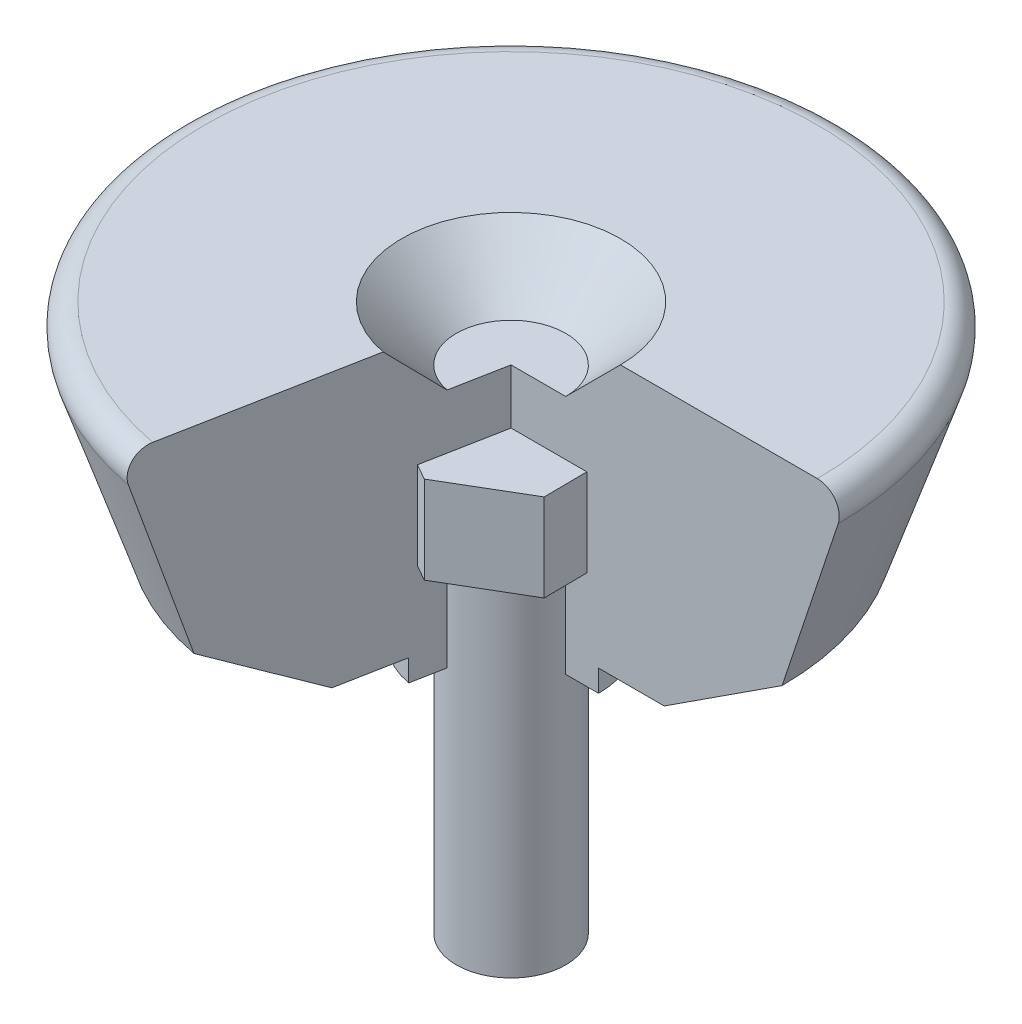
ISO-10303-21;
HEADER;
FILE_DESCRIPTION(('STEP AP214'),'2;1');
FILE_NAME('part.step','',(''),(''),'','','');
FILE_SCHEMA(('AUTOMOTIVE_DESIGN { 1 0 10303 214 1 1 1 1 }'));
ENDSEC;
DATA;
#1=APPLICATION_CONTEXT('core data for automotive mechanical design processes');
#2=APPLICATION_PROTOCOL_DEFINITION('international standard','automotive_design',2000,#1);
#3=PRODUCT_CONTEXT('',#1,'mechanical');
#4=PRODUCT('Part','Part','',(#3));
#5=PRODUCT_RELATED_PRODUCT_CATEGORY('part','',(#4));
#6=PRODUCT_DEFINITION_FORMATION('','',#4);
#7=PRODUCT_DEFINITION_CONTEXT('part definition',#1,'design');
#8=PRODUCT_DEFINITION('design','',#6,#7);
#9=PRODUCT_DEFINITION_SHAPE('','',#8);
#10=(LENGTH_UNIT() NAMED_UNIT(*) SI_UNIT(.MILLI.,.METRE.));
#11=(NAMED_UNIT(*) PLANE_ANGLE_UNIT() SI_UNIT($,.RADIAN.));
#12=(NAMED_UNIT(*) SI_UNIT($,.STERADIAN.) SOLID_ANGLE_UNIT());
#13=UNCERTAINTY_MEASURE_WITH_UNIT(LENGTH_MEASURE(1.E-05),#10,'distance_accuracy_value','');
#14=(GEOMETRIC_REPRESENTATION_CONTEXT(3) GLOBAL_UNCERTAINTY_ASSIGNED_CONTEXT((#13)) GLOBAL_UNIT_ASSIGNED_CONTEXT((#10,
#11,#12)) REPRESENTATION_CONTEXT('',''));
#15=CARTESIAN_POINT('',(0.,0.,0.));
#16=DIRECTION('',(0.,0.,1.));
#17=DIRECTION('',(1.,0.,0.));
#18=AXIS2_PLACEMENT_3D('',#15,#16,#17);
#19=CARTESIAN_POINT('',(0.,0.,0.));
#20=DIRECTION('',(0.,1.,0.));
#21=DIRECTION('',(0.,0.,1.));
#22=AXIS2_PLACEMENT_3D('',#19,#20,#21);
#23=CYLINDRICAL_SURFACE('',#22,5.);
#24=CARTESIAN_POINT('',(0.,0.,0.));
#25=DIRECTION('',(0.,1.,0.));
#26=DIRECTION('',(0.,0.,1.));
#27=AXIS2_PLACEMENT_3D('',#24,#25,#26);
#28=CIRCLE('',#27,5.);
#29=CARTESIAN_POINT('',(0.,0.,5.));
#30=VERTEX_POINT('',#29);
#31=EDGE_CURVE('E12',#30,#30,#28,.T.);
#32=ORIENTED_EDGE('',*,*,#31,.T.);
#33=EDGE_LOOP('',(#32));
#34=FACE_BOUND('',#33,.T.);
#35=CARTESIAN_POINT('',(0.,32.,0.));
#36=DIRECTION('',(0.,1.,0.));
#37=DIRECTION('',(0.,0.,1.));
#38=AXIS2_PLACEMENT_3D('',#35,#36,#37);
#39=CIRCLE('',#38,5.);
#40=CARTESIAN_POINT('',(0.,32.,5.));
#41=VERTEX_POINT('',#40);
#42=EDGE_CURVE('E47',#41,#41,#39,.T.);
#43=ORIENTED_EDGE('',*,*,#42,.F.);
#44=EDGE_LOOP('',(#43));
#45=FACE_BOUND('',#44,.T.);
#46=ADVANCED_FACE('F44',(#34,#45),#23,.T.);
#47=CARTESIAN_POINT('',(0.,0.,0.));
#48=DIRECTION('',(0.,1.,0.));
#49=DIRECTION('',(0.,0.,1.));
#50=AXIS2_PLACEMENT_3D('',#47,#48,#49);
#51=PLANE('',#50);
#52=ORIENTED_EDGE('',*,*,#31,.F.);
#53=EDGE_LOOP('',(#52));
#54=FACE_BOUND('',#53,.T.);
#55=ADVANCED_FACE('F59',(#54),#51,.F.);
#56=CARTESIAN_POINT('',(0.,32.,0.));
#57=DIRECTION('',(0.,1.,0.));
#58=DIRECTION('',(0.,0.,1.));
#59=AXIS2_PLACEMENT_3D('',#56,#57,#58);
#60=PLANE('',#59);
#61=ORIENTED_EDGE('',*,*,#42,.T.);
#62=EDGE_LOOP('',(#61));
#63=FACE_BOUND('',#62,.T.);
#64=ADVANCED_FACE('F56',(#63),#60,.T.);
#65=CLOSED_SHELL('',(#46,#55,#64));
#66=MANIFOLD_SOLID_BREP('B2',#65);
#67=CARTESIAN_POINT('',(6.89136035458419,32.,-4.06314563648232));
#68=DIRECTION('',(0.492065039432711,0.,-0.870558439720209));
#69=DIRECTION('',(-0.870558439720209,0.,-0.492065039432711));
#70=AXIS2_PLACEMENT_3D('',#67,#68,#69);
#71=PLANE('',#70);
#72=DIRECTION('',(-0.870558439720209,0.,-0.492065039432711));
#73=VECTOR('',#72,1.);
#74=CARTESIAN_POINT('',(6.89136035458419,40.,-4.06314563648232));
#75=LINE('',#74,#73);
#76=CARTESIAN_POINT('',(6.89136035458419,40.,-4.06314563648232));
#77=VERTEX_POINT('',#76);
#78=CARTESIAN_POINT('',(-0.0731071631774839,40.,-7.999665951944));
#79=VERTEX_POINT('',#78);
#80=EDGE_CURVE('E179',#77,#79,#75,.T.);
#81=ORIENTED_EDGE('',*,*,#80,.F.);
#82=DIRECTION('',(0.,1.,0.));
#83=VECTOR('',#82,1.);
#84=CARTESIAN_POINT('',(6.89136035458419,32.,-4.06314563648232));
#85=LINE('',#84,#83);
#86=CARTESIAN_POINT('',(6.89136035458419,32.,-4.06314563648232));
#87=VERTEX_POINT('',#86);
#88=EDGE_CURVE('E42',#87,#77,#85,.T.);
#89=ORIENTED_EDGE('',*,*,#88,.F.);
#90=DIRECTION('',(-0.870558439720209,0.,-0.492065039432711));
#91=VECTOR('',#90,1.);
#92=CARTESIAN_POINT('',(6.89136035458419,32.,-4.06314563648232));
#93=LINE('',#92,#91);
#94=CARTESIAN_POINT('',(-0.0731071631774839,32.,-7.999665951944));
#95=VERTEX_POINT('',#94);
#96=EDGE_CURVE('E193',#87,#95,#93,.T.);
#97=ORIENTED_EDGE('',*,*,#96,.T.);
#98=DIRECTION('',(0.,1.,0.));
#99=VECTOR('',#98,1.);
#100=CARTESIAN_POINT('',(-0.0731071631774839,32.,-7.999665951944));
#101=LINE('',#100,#99);
#102=EDGE_CURVE('E97',#95,#79,#101,.T.);
#103=ORIENTED_EDGE('',*,*,#102,.T.);
#104=EDGE_LOOP('',(#81,#89,#97,#103));
#105=FACE_BOUND('',#104,.T.);
#106=ADVANCED_FACE('F94',(#105),#71,.T.);
#107=CARTESIAN_POINT('',(6.96446751776167,32.,3.93652031546169));
#108=DIRECTION('',(0.999958243993,0.,-0.00913839539718527));
#109=DIRECTION('',(-0.00913839539718527,0.,-0.999958243993));
#110=AXIS2_PLACEMENT_3D('',#107,#108,#109);
#111=PLANE('',#110);
#112=DIRECTION('',(-0.00913839539718527,0.,-0.999958243993));
#113=VECTOR('',#112,1.);
#114=CARTESIAN_POINT('',(6.96446751776167,40.,3.93652031546169));
#115=LINE('',#114,#113);
#116=CARTESIAN_POINT('',(6.96446751776167,40.,3.93652031546169));
#117=VERTEX_POINT('',#116);
#118=EDGE_CURVE('E191',#117,#77,#115,.T.);
#119=ORIENTED_EDGE('',*,*,#118,.F.);
#120=DIRECTION('',(0.,1.,0.));
#121=VECTOR('',#120,1.);
#122=CARTESIAN_POINT('',(6.96446751776167,32.,3.93652031546169));
#123=LINE('',#122,#121);
#124=CARTESIAN_POINT('',(6.96446751776167,32.,3.93652031546169));
#125=VERTEX_POINT('',#124);
#126=EDGE_CURVE('E103',#125,#117,#123,.T.);
#127=ORIENTED_EDGE('',*,*,#126,.F.);
#128=DIRECTION('',(-0.00913839539718527,0.,-0.999958243993));
#129=VECTOR('',#128,1.);
#130=CARTESIAN_POINT('',(6.96446751776167,32.,3.93652031546169));
#131=LINE('',#130,#129);
#132=EDGE_CURVE('E169',#125,#87,#131,.T.);
#133=ORIENTED_EDGE('',*,*,#132,.T.);
#134=ORIENTED_EDGE('',*,*,#88,.T.);
#135=EDGE_LOOP('',(#119,#127,#133,#134));
#136=FACE_BOUND('',#135,.T.);
#137=ADVANCED_FACE('F201',(#136),#111,.T.);
#138=CARTESIAN_POINT('',(0.0731071631774813,32.,7.999665951944));
#139=DIRECTION('',(0.507893204560289,0.,0.861420044323024));
#140=DIRECTION('',(0.861420044323024,0.,-0.507893204560289));
#141=AXIS2_PLACEMENT_3D('',#138,#139,#140);
#142=PLANE('',#141);
#143=DIRECTION('',(0.861420044323024,0.,-0.507893204560289));
#144=VECTOR('',#143,1.);
#145=CARTESIAN_POINT('',(0.0731071631774813,40.,7.999665951944));
#146=LINE('',#145,#144);
#147=CARTESIAN_POINT('',(0.0731071631774813,40.,7.999665951944));
#148=VERTEX_POINT('',#147);
#149=EDGE_CURVE('E156',#148,#117,#146,.T.);
#150=ORIENTED_EDGE('',*,*,#149,.F.);
#151=DIRECTION('',(0.,1.,0.));
#152=VECTOR('',#151,1.);
#153=CARTESIAN_POINT('',(0.0731071631774813,32.,7.999665951944));
#154=LINE('',#153,#152);
#155=CARTESIAN_POINT('',(0.0731071631774813,32.,7.999665951944));
#156=VERTEX_POINT('',#155);
#157=EDGE_CURVE('E151',#156,#148,#154,.T.);
#158=ORIENTED_EDGE('',*,*,#157,.F.);
#159=DIRECTION('',(0.861420044323024,0.,-0.507893204560289));
#160=VECTOR('',#159,1.);
#161=CARTESIAN_POINT('',(0.0731071631774813,32.,7.999665951944));
#162=LINE('',#161,#160);
#163=EDGE_CURVE('E154',#156,#125,#162,.T.);
#164=ORIENTED_EDGE('',*,*,#163,.T.);
#165=ORIENTED_EDGE('',*,*,#126,.T.);
#166=EDGE_LOOP('',(#150,#158,#164,#165));
#167=FACE_BOUND('',#166,.T.);
#168=ADVANCED_FACE('F153',(#167),#142,.T.);
#169=CARTESIAN_POINT('',(-6.89136035458419,32.,4.06314563648231));
#170=DIRECTION('',(-0.492065039432711,0.,0.870558439720209));
#171=DIRECTION('',(0.870558439720209,0.,0.492065039432711));
#172=AXIS2_PLACEMENT_3D('',#169,#170,#171);
#173=PLANE('',#172);
#174=DIRECTION('',(0.870558439720209,0.,0.492065039432711));
#175=VECTOR('',#174,1.);
#176=CARTESIAN_POINT('',(-6.89136035458419,40.,4.06314563648231));
#177=LINE('',#176,#175);
#178=CARTESIAN_POINT('',(-6.89136035458419,40.,4.06314563648231));
#179=VERTEX_POINT('',#178);
#180=EDGE_CURVE('E188',#179,#148,#177,.T.);
#181=ORIENTED_EDGE('',*,*,#180,.F.);
#182=DIRECTION('',(0.,1.,0.));
#183=VECTOR('',#182,1.);
#184=CARTESIAN_POINT('',(-6.89136035458419,32.,4.06314563648231));
#185=LINE('',#184,#183);
#186=CARTESIAN_POINT('',(-6.89136035458419,32.,4.06314563648231));
#187=VERTEX_POINT('',#186);
#188=EDGE_CURVE('E161',#187,#179,#185,.T.);
#189=ORIENTED_EDGE('',*,*,#188,.F.);
#190=DIRECTION('',(0.870558439720209,0.,0.492065039432711));
#191=VECTOR('',#190,1.);
#192=CARTESIAN_POINT('',(-6.89136035458419,32.,4.06314563648231));
#193=LINE('',#192,#191);
#194=EDGE_CURVE('E167',#187,#156,#193,.T.);
#195=ORIENTED_EDGE('',*,*,#194,.T.);
#196=ORIENTED_EDGE('',*,*,#157,.T.);
#197=EDGE_LOOP('',(#181,#189,#195,#196));
#198=FACE_BOUND('',#197,.T.);
#199=ADVANCED_FACE('F171',(#198),#173,.T.);
#200=CARTESIAN_POINT('',(-6.96446751776167,32.,-3.93652031546169));
#201=DIRECTION('',(-0.999958243993,0.,0.00913839539718538));
#202=DIRECTION('',(0.00913839539718538,0.,0.999958243993));
#203=AXIS2_PLACEMENT_3D('',#200,#201,#202);
#204=PLANE('',#203);
#205=DIRECTION('',(0.00913839539718538,0.,0.999958243993));
#206=VECTOR('',#205,1.);
#207=CARTESIAN_POINT('',(-6.96446751776167,40.,-3.93652031546169));
#208=LINE('',#207,#206);
#209=CARTESIAN_POINT('',(-6.96446751776167,40.,-3.93652031546169));
#210=VERTEX_POINT('',#209);
#211=EDGE_CURVE('E185',#210,#179,#208,.T.);
#212=ORIENTED_EDGE('',*,*,#211,.F.);
#213=DIRECTION('',(0.,1.,0.));
#214=VECTOR('',#213,1.);
#215=CARTESIAN_POINT('',(-6.96446751776167,32.,-3.93652031546169));
#216=LINE('',#215,#214);
#217=CARTESIAN_POINT('',(-6.96446751776167,32.,-3.93652031546169));
#218=VERTEX_POINT('',#217);
#219=EDGE_CURVE('E196',#218,#210,#216,.T.);
#220=ORIENTED_EDGE('',*,*,#219,.F.);
#221=DIRECTION('',(0.00913839539718538,0.,0.999958243993));
#222=VECTOR('',#221,1.);
#223=CARTESIAN_POINT('',(-6.96446751776167,32.,-3.93652031546169));
#224=LINE('',#223,#222);
#225=EDGE_CURVE('E172',#218,#187,#224,.T.);
#226=ORIENTED_EDGE('',*,*,#225,.T.);
#227=ORIENTED_EDGE('',*,*,#188,.T.);
#228=EDGE_LOOP('',(#212,#220,#226,#227));
#229=FACE_BOUND('',#228,.T.);
#230=ADVANCED_FACE('F214',(#229),#204,.T.);
#231=CARTESIAN_POINT('',(-0.0731071631774839,32.,-7.999665951944));
#232=DIRECTION('',(-0.50789320456029,0.,-0.861420044323024));
#233=DIRECTION('',(-0.861420044323024,0.,0.50789320456029));
#234=AXIS2_PLACEMENT_3D('',#231,#232,#233);
#235=PLANE('',#234);
#236=DIRECTION('',(-0.861420044323024,0.,0.50789320456029));
#237=VECTOR('',#236,1.);
#238=CARTESIAN_POINT('',(-0.0731071631774839,40.,-7.999665951944));
#239=LINE('',#238,#237);
#240=EDGE_CURVE('E182',#79,#210,#239,.T.);
#241=ORIENTED_EDGE('',*,*,#240,.F.);
#242=ORIENTED_EDGE('',*,*,#102,.F.);
#243=DIRECTION('',(-0.861420044323024,0.,0.50789320456029));
#244=VECTOR('',#243,1.);
#245=CARTESIAN_POINT('',(-0.0731071631774839,32.,-7.999665951944));
#246=LINE('',#245,#244);
#247=EDGE_CURVE('E174',#95,#218,#246,.T.);
#248=ORIENTED_EDGE('',*,*,#247,.T.);
#249=ORIENTED_EDGE('',*,*,#219,.T.);
#250=EDGE_LOOP('',(#241,#242,#248,#249));
#251=FACE_BOUND('',#250,.T.);
#252=ADVANCED_FACE('F198',(#251),#235,.T.);
#253=CARTESIAN_POINT('',(0.,32.,0.));
#254=DIRECTION('',(0.,1.,0.));
#255=DIRECTION('',(0.,0.,1.));
#256=AXIS2_PLACEMENT_3D('',#253,#254,#255);
#257=PLANE('',#256);
#258=ORIENTED_EDGE('',*,*,#96,.F.);
#259=ORIENTED_EDGE('',*,*,#132,.F.);
#260=ORIENTED_EDGE('',*,*,#163,.F.);
#261=ORIENTED_EDGE('',*,*,#194,.F.);
#262=ORIENTED_EDGE('',*,*,#225,.F.);
#263=ORIENTED_EDGE('',*,*,#247,.F.);
#264=EDGE_LOOP('',(#258,#259,#260,#261,#262,#263));
#265=FACE_BOUND('',#264,.T.);
#266=ADVANCED_FACE('F165',(#265),#257,.F.);
#267=CARTESIAN_POINT('',(0.,40.,0.));
#268=DIRECTION('',(0.,1.,0.));
#269=DIRECTION('',(0.,0.,1.));
#270=AXIS2_PLACEMENT_3D('',#267,#268,#269);
#271=PLANE('',#270);
#272=ORIENTED_EDGE('',*,*,#80,.T.);
#273=ORIENTED_EDGE('',*,*,#240,.T.);
#274=ORIENTED_EDGE('',*,*,#211,.T.);
#275=ORIENTED_EDGE('',*,*,#180,.T.);
#276=ORIENTED_EDGE('',*,*,#149,.T.);
#277=ORIENTED_EDGE('',*,*,#118,.T.);
#278=EDGE_LOOP('',(#272,#273,#274,#275,#276,#277));
#279=FACE_BOUND('',#278,.T.);
#280=ADVANCED_FACE('F200',(#279),#271,.T.);
#281=CLOSED_SHELL('',(#106,#137,#168,#199,#230,#252,#266,#280));
#282=MANIFOLD_SOLID_BREP('B7',#281);
#283=CARTESIAN_POINT('',(-5.24667680839211,48.,27.5040430204048));
#284=DIRECTION('',(0.982287250728744,0.,0.187381314585432));
#285=DIRECTION('',(0.187381314585432,0.,-0.982287250728744));
#286=AXIS2_PLACEMENT_3D('',#283,#284,#285);
#287=PLANE('',#286);
#288=DIRECTION('',(0.,-1.,0.));
#289=VECTOR('',#288,1.);
#290=CARTESIAN_POINT('',(0.,50.,0.));
#291=LINE('',#290,#289);
#292=CARTESIAN_POINT('',(0.,45.,0.));
#293=VERTEX_POINT('',#292);
#294=CARTESIAN_POINT('',(0.,23.,0.));
#295=VERTEX_POINT('',#294);
#296=EDGE_CURVE('E363',#293,#295,#291,.T.);
#297=ORIENTED_EDGE('',*,*,#296,.F.);
#298=DIRECTION('',(-0.187381314585432,0.,0.982287250728744));
#299=VECTOR('',#298,1.);
#300=CARTESIAN_POINT('',(-5.24667680839211,45.,27.5040430204048));
#301=LINE('',#300,#299);
#302=CARTESIAN_POINT('',(-0.936906289233362,45.,4.91143476570809));
#303=VERTEX_POINT('',#302);
#304=EDGE_CURVE('E421',#293,#303,#301,.T.);
#305=ORIENTED_EDGE('',*,*,#304,.T.);
#306=DIRECTION('',(0.132498598211009,-0.707106781186548,-0.694581976063385));
#307=VECTOR('',#306,1.);
#308=CARTESIAN_POINT('',(0.,40.,0.));
#309=LINE('',#308,#307);
#310=CARTESIAN_POINT('',(-1.87381341300556,50.,9.82287390745386));
#311=VERTEX_POINT('',#310);
#312=EDGE_CURVE('E420',#311,#303,#309,.T.);
#313=ORIENTED_EDGE('',*,*,#312,.F.);
#314=DIRECTION('',(0.187381314585432,0.,-0.982287250728744));
#315=VECTOR('',#314,1.);
#316=CARTESIAN_POINT('',(-5.24667680839211,50.,27.5040430204048));
#317=LINE('',#316,#315);
#318=CARTESIAN_POINT('',(-5.24667680839211,50.,27.5040430204048));
#319=VERTEX_POINT('',#318);
#320=EDGE_CURVE('E355',#319,#311,#317,.T.);
#321=ORIENTED_EDGE('',*,*,#320,.F.);
#322=CARTESIAN_POINT('',(-5.24667680839211,48.,27.5040430204048));
#323=DIRECTION('',(-0.982287250728744,0.,-0.187381314585432));
#324=DIRECTION('',(0.187381314585432,0.,-0.982287250728744));
#325=AXIS2_PLACEMENT_3D('',#322,#323,#324);
#326=CIRCLE('',#325,2.);
#327=CARTESIAN_POINT('',(-5.60220785542,47.3675444679663,29.3678020377135));
#328=VERTEX_POINT('',#327);
#329=EDGE_CURVE('E390',#328,#319,#326,.T.);
#330=ORIENTED_EDGE('',*,*,#329,.F.);
#331=DIRECTION('',(-0.0592551745046496,0.948683298050514,0.310626502884773));
#332=VECTOR('',#331,1.);
#333=CARTESIAN_POINT('',(-4.64234429396746,32.,24.33602103575));
#334=LINE('',#333,#332);
#335=CARTESIAN_POINT('',(-4.64234429396746,32.,24.33602103575));
#336=VERTEX_POINT('',#335);
#337=EDGE_CURVE('E387',#336,#328,#334,.T.);
#338=ORIENTED_EDGE('',*,*,#337,.F.);
#339=DIRECTION('',(-0.157133009507986,0.54478843876995,0.823720082494996));
#340=VECTOR('',#339,1.);
#341=CARTESIAN_POINT('',(-2.62333840419605,25.,13.7520215102024));
#342=LINE('',#341,#340);
#343=CARTESIAN_POINT('',(-2.62333840419605,25.,13.7520215102024));
#344=VERTEX_POINT('',#343);
#345=EDGE_CURVE('E384',#344,#336,#342,.T.);
#346=ORIENTED_EDGE('',*,*,#345,.F.);
#347=DIRECTION('',(-0.187381314585432,0.,0.982287250728744));
#348=VECTOR('',#347,1.);
#349=CARTESIAN_POINT('',(-1.49905051668346,25.,7.85829800582996));
#350=LINE('',#349,#348);
#351=CARTESIAN_POINT('',(-1.49905051668346,25.,7.85829800582996));
#352=VERTEX_POINT('',#351);
#353=EDGE_CURVE('E381',#352,#344,#350,.T.);
#354=ORIENTED_EDGE('',*,*,#353,.F.);
#355=DIRECTION('',(0.,1.,0.));
#356=VECTOR('',#355,1.);
#357=CARTESIAN_POINT('',(-1.49905051668346,23.,7.85829800582996));
#358=LINE('',#357,#356);
#359=CARTESIAN_POINT('',(-1.49905051668346,23.,7.85829800582996));
#360=VERTEX_POINT('',#359);
#361=EDGE_CURVE('E378',#360,#352,#358,.T.);
#362=ORIENTED_EDGE('',*,*,#361,.F.);
#363=DIRECTION('',(-0.187381314585432,0.,0.982287250728744));
#364=VECTOR('',#363,1.);
#365=CARTESIAN_POINT('',(0.,23.,0.));
#366=LINE('',#365,#364);
#367=EDGE_CURVE('E365',#295,#360,#366,.T.);
#368=ORIENTED_EDGE('',*,*,#367,.F.);
#369=EDGE_LOOP('',(#297,#305,#313,#321,#330,#338,#346,#354,#362,#368));
#370=FACE_BOUND('',#369,.T.);
#371=ADVANCED_FACE('F270',(#370),#287,.T.);
#372=CARTESIAN_POINT('',(28.,48.,0.));
#373=DIRECTION('',(0.,0.,-1.));
#374=DIRECTION('',(-1.,0.,0.));
#375=AXIS2_PLACEMENT_3D('',#372,#373,#374);
#376=PLANE('',#375);
#377=DIRECTION('',(1.,0.,0.));
#378=VECTOR('',#377,1.);
#379=CARTESIAN_POINT('',(28.,45.,0.));
#380=LINE('',#379,#378);
#381=CARTESIAN_POINT('',(5.,45.,0.));
#382=VERTEX_POINT('',#381);
#383=EDGE_CURVE('E92',#293,#382,#380,.T.);
#384=ORIENTED_EDGE('',*,*,#383,.F.);
#385=ORIENTED_EDGE('',*,*,#296,.T.);
#386=DIRECTION('',(1.,0.,0.));
#387=VECTOR('',#386,1.);
#388=CARTESIAN_POINT('',(0.,23.,0.));
#389=LINE('',#388,#387);
#390=CARTESIAN_POINT('',(8.,23.,0.));
#391=VERTEX_POINT('',#390);
#392=EDGE_CURVE('E423',#295,#391,#389,.T.);
#393=ORIENTED_EDGE('',*,*,#392,.T.);
#394=DIRECTION('',(0.,1.,0.));
#395=VECTOR('',#394,1.);
#396=CARTESIAN_POINT('',(8.,23.,0.));
#397=LINE('',#396,#395);
#398=CARTESIAN_POINT('',(8.,25.,0.));
#399=VERTEX_POINT('',#398);
#400=EDGE_CURVE('E433',#391,#399,#397,.T.);
#401=ORIENTED_EDGE('',*,*,#400,.T.);
#402=DIRECTION('',(1.,0.,0.));
#403=VECTOR('',#402,1.);
#404=CARTESIAN_POINT('',(8.,25.,0.));
#405=LINE('',#404,#403);
#406=CARTESIAN_POINT('',(14.,25.,0.));
#407=VERTEX_POINT('',#406);
#408=EDGE_CURVE('E435',#399,#407,#405,.T.);
#409=ORIENTED_EDGE('',*,*,#408,.T.);
#410=DIRECTION('',(0.838573525090436,0.54478843876995,0.));
#411=VECTOR('',#410,1.);
#412=CARTESIAN_POINT('',(14.,25.,0.));
#413=LINE('',#412,#411);
#414=CARTESIAN_POINT('',(24.7748517734456,32.,0.));
#415=VERTEX_POINT('',#414);
#416=EDGE_CURVE('E438',#407,#415,#413,.T.);
#417=ORIENTED_EDGE('',*,*,#416,.T.);
#418=DIRECTION('',(0.316227766016838,0.948683298050514,0.));
#419=VECTOR('',#418,1.);
#420=CARTESIAN_POINT('',(24.7748517734456,32.,0.));
#421=LINE('',#420,#419);
#422=CARTESIAN_POINT('',(29.897366596101,47.3675444679663,0.));
#423=VERTEX_POINT('',#422);
#424=EDGE_CURVE('E367',#415,#423,#421,.T.);
#425=ORIENTED_EDGE('',*,*,#424,.T.);
#426=CARTESIAN_POINT('',(28.,48.,0.));
#427=DIRECTION('',(0.,0.,1.));
#428=DIRECTION('',(-1.,0.,0.));
#429=AXIS2_PLACEMENT_3D('',#426,#427,#428);
#430=CIRCLE('',#429,2.);
#431=CARTESIAN_POINT('',(28.,50.,0.));
#432=VERTEX_POINT('',#431);
#433=EDGE_CURVE('E362',#423,#432,#430,.T.);
#434=ORIENTED_EDGE('',*,*,#433,.T.);
#435=DIRECTION('',(-1.,0.,0.));
#436=VECTOR('',#435,1.);
#437=CARTESIAN_POINT('',(28.,50.,0.));
#438=LINE('',#437,#436);
#439=CARTESIAN_POINT('',(10.,50.,0.));
#440=VERTEX_POINT('',#439);
#441=EDGE_CURVE('E353',#432,#440,#438,.T.);
#442=ORIENTED_EDGE('',*,*,#441,.T.);
#443=DIRECTION('',(-0.707106781186547,-0.707106781186548,0.));
#444=VECTOR('',#443,1.);
#445=CARTESIAN_POINT('',(0.,40.,0.));
#446=LINE('',#445,#444);
#447=EDGE_CURVE('E281',#440,#382,#446,.T.);
#448=ORIENTED_EDGE('',*,*,#447,.T.);
#449=EDGE_LOOP('',(#384,#385,#393,#401,#409,#417,#425,#434,#442,#448));
#450=FACE_BOUND('',#449,.T.);
#451=ADVANCED_FACE('F359',(#450),#376,.F.);
#452=CARTESIAN_POINT('',(-5.24667680839211,50.,27.5040430204048));
#453=DIRECTION('',(0.,1.,0.));
#454=DIRECTION('',(0.,0.,1.));
#455=AXIS2_PLACEMENT_3D('',#452,#453,#454);
#456=PLANE('',#455);
#457=CARTESIAN_POINT('',(0.,50.,0.));
#458=DIRECTION('',(0.,1.,0.));
#459=DIRECTION('',(0.,0.,1.));
#460=AXIS2_PLACEMENT_3D('',#457,#458,#459);
#461=CIRCLE('',#460,10.);
#462=EDGE_CURVE('E345',#440,#311,#461,.T.);
#463=ORIENTED_EDGE('',*,*,#462,.F.);
#464=ORIENTED_EDGE('',*,*,#441,.F.);
#465=CARTESIAN_POINT('',(0.,50.,0.));
#466=DIRECTION('',(0.,-1.,0.));
#467=DIRECTION('',(0.,0.,-1.));
#468=AXIS2_PLACEMENT_3D('',#465,#466,#467);
#469=CIRCLE('',#468,28.);
#470=EDGE_CURVE('E296',#319,#432,#469,.T.);
#471=ORIENTED_EDGE('',*,*,#470,.F.);
#472=ORIENTED_EDGE('',*,*,#320,.T.);
#473=EDGE_LOOP('',(#463,#464,#471,#472));
#474=FACE_BOUND('',#473,.T.);
#475=ADVANCED_FACE('F272',(#474),#456,.T.);
#476=CARTESIAN_POINT('',(0.,48.,0.));
#477=DIRECTION('',(0.,-1.,0.));
#478=DIRECTION('',(0.,0.,-1.));
#479=AXIS2_PLACEMENT_3D('',#476,#477,#478);
#480=TOROIDAL_SURFACE('',#479,28.,2.);
#481=CARTESIAN_POINT('',(0.,47.3675444679663,0.));
#482=DIRECTION('',(0.,-1.,0.));
#483=DIRECTION('',(0.,0.,-1.));
#484=AXIS2_PLACEMENT_3D('',#481,#482,#483);
#485=CIRCLE('',#484,29.897366596101);
#486=EDGE_CURVE('E410',#328,#423,#485,.T.);
#487=ORIENTED_EDGE('',*,*,#486,.F.);
#488=ORIENTED_EDGE('',*,*,#329,.T.);
#489=ORIENTED_EDGE('',*,*,#470,.T.);
#490=ORIENTED_EDGE('',*,*,#433,.F.);
#491=EDGE_LOOP('',(#487,#488,#489,#490));
#492=FACE_BOUND('',#491,.T.);
#493=ADVANCED_FACE('F414',(#492),#480,.T.);
#494=CARTESIAN_POINT('',(0.,32.,0.));
#495=DIRECTION('',(0.,1.,0.));
#496=DIRECTION('',(0.,0.,1.));
#497=AXIS2_PLACEMENT_3D('',#494,#495,#496);
#498=CONICAL_SURFACE('',#497,24.7748517734456,0.321750554396642);
#499=CARTESIAN_POINT('',(0.,32.,0.));
#500=DIRECTION('',(0.,-1.,0.));
#501=DIRECTION('',(0.,0.,-1.));
#502=AXIS2_PLACEMENT_3D('',#499,#500,#501);
#503=CIRCLE('',#502,24.7748517734456);
#504=EDGE_CURVE('E407',#336,#415,#503,.T.);
#505=ORIENTED_EDGE('',*,*,#504,.F.);
#506=ORIENTED_EDGE('',*,*,#337,.T.);
#507=ORIENTED_EDGE('',*,*,#486,.T.);
#508=ORIENTED_EDGE('',*,*,#424,.F.);
#509=EDGE_LOOP('',(#505,#506,#507,#508));
#510=FACE_BOUND('',#509,.T.);
#511=ADVANCED_FACE('F441',(#510),#498,.T.);
#512=CARTESIAN_POINT('',(0.,25.,0.));
#513=DIRECTION('',(0.,1.,0.));
#514=DIRECTION('',(0.,0.,1.));
#515=AXIS2_PLACEMENT_3D('',#512,#513,#514);
#516=CONICAL_SURFACE('',#515,14.,0.994659519776935);
#517=CARTESIAN_POINT('',(0.,25.,0.));
#518=DIRECTION('',(0.,-1.,0.));
#519=DIRECTION('',(0.,0.,-1.));
#520=AXIS2_PLACEMENT_3D('',#517,#518,#519);
#521=CIRCLE('',#520,14.);
#522=EDGE_CURVE('E403',#344,#407,#521,.T.);
#523=ORIENTED_EDGE('',*,*,#522,.F.);
#524=ORIENTED_EDGE('',*,*,#345,.T.);
#525=ORIENTED_EDGE('',*,*,#504,.T.);
#526=ORIENTED_EDGE('',*,*,#416,.F.);
#527=EDGE_LOOP('',(#523,#524,#525,#526));
#528=FACE_BOUND('',#527,.T.);
#529=ADVANCED_FACE('F444',(#528),#516,.T.);
#530=CARTESIAN_POINT('',(-1.49905051668346,25.,7.85829800582996));
#531=DIRECTION('',(0.,-1.,0.));
#532=DIRECTION('',(0.,0.,-1.));
#533=AXIS2_PLACEMENT_3D('',#530,#531,#532);
#534=PLANE('',#533);
#535=CARTESIAN_POINT('',(0.,25.,0.));
#536=DIRECTION('',(0.,-1.,0.));
#537=DIRECTION('',(0.,0.,-1.));
#538=AXIS2_PLACEMENT_3D('',#535,#536,#537);
#539=CIRCLE('',#538,8.);
#540=EDGE_CURVE('E399',#352,#399,#539,.T.);
#541=ORIENTED_EDGE('',*,*,#540,.F.);
#542=ORIENTED_EDGE('',*,*,#353,.T.);
#543=ORIENTED_EDGE('',*,*,#522,.T.);
#544=ORIENTED_EDGE('',*,*,#408,.F.);
#545=EDGE_LOOP('',(#541,#542,#543,#544));
#546=FACE_BOUND('',#545,.T.);
#547=ADVANCED_FACE('F449',(#546),#534,.T.);
#548=CARTESIAN_POINT('',(0.,0.,0.));
#549=DIRECTION('',(0.,-1.,0.));
#550=DIRECTION('',(0.,0.,-1.));
#551=AXIS2_PLACEMENT_3D('',#548,#549,#550);
#552=CYLINDRICAL_SURFACE('',#551,8.);
#553=CARTESIAN_POINT('',(0.,23.,0.));
#554=DIRECTION('',(0.,-1.,0.));
#555=DIRECTION('',(0.,0.,-1.));
#556=AXIS2_PLACEMENT_3D('',#553,#554,#555);
#557=CIRCLE('',#556,8.);
#558=EDGE_CURVE('E394',#360,#391,#557,.T.);
#559=ORIENTED_EDGE('',*,*,#558,.F.);
#560=ORIENTED_EDGE('',*,*,#361,.T.);
#561=ORIENTED_EDGE('',*,*,#540,.T.);
#562=ORIENTED_EDGE('',*,*,#400,.F.);
#563=EDGE_LOOP('',(#559,#560,#561,#562));
#564=FACE_BOUND('',#563,.T.);
#565=ADVANCED_FACE('F451',(#564),#552,.T.);
#566=CARTESIAN_POINT('',(0.,23.,0.));
#567=DIRECTION('',(0.,-1.,0.));
#568=DIRECTION('',(0.,0.,-1.));
#569=AXIS2_PLACEMENT_3D('',#566,#567,#568);
#570=PLANE('',#569);
#571=ORIENTED_EDGE('',*,*,#367,.T.);
#572=ORIENTED_EDGE('',*,*,#558,.T.);
#573=ORIENTED_EDGE('',*,*,#392,.F.);
#574=EDGE_LOOP('',(#571,#572,#573));
#575=FACE_BOUND('',#574,.T.);
#576=ADVANCED_FACE('F452',(#575),#570,.T.);
#577=CARTESIAN_POINT('',(0.,45.,0.));
#578=DIRECTION('',(0.,1.,0.));
#579=DIRECTION('',(0.,0.,1.));
#580=AXIS2_PLACEMENT_3D('',#577,#578,#579);
#581=PLANE('',#580);
#582=ORIENTED_EDGE('',*,*,#383,.T.);
#583=CARTESIAN_POINT('',(0.,45.,0.));
#584=DIRECTION('',(0.,1.,0.));
#585=DIRECTION('',(0.,0.,1.));
#586=AXIS2_PLACEMENT_3D('',#583,#584,#585);
#587=CIRCLE('',#586,5.);
#588=EDGE_CURVE('E275',#382,#303,#587,.T.);
#589=ORIENTED_EDGE('',*,*,#588,.T.);
#590=ORIENTED_EDGE('',*,*,#304,.F.);
#591=EDGE_LOOP('',(#582,#589,#590));
#592=FACE_BOUND('',#591,.T.);
#593=ADVANCED_FACE('F454',(#592),#581,.T.);
#594=CARTESIAN_POINT('',(0.,45.,0.));
#595=DIRECTION('',(0.,1.,0.));
#596=DIRECTION('',(0.,0.,1.));
#597=AXIS2_PLACEMENT_3D('',#594,#595,#596);
#598=CONICAL_SURFACE('',#597,5.,0.785398163397448);
#599=ORIENTED_EDGE('',*,*,#312,.T.);
#600=ORIENTED_EDGE('',*,*,#588,.F.);
#601=ORIENTED_EDGE('',*,*,#447,.F.);
#602=ORIENTED_EDGE('',*,*,#462,.T.);
#603=EDGE_LOOP('',(#599,#600,#601,#602));
#604=FACE_BOUND('',#603,.T.);
#605=ADVANCED_FACE('F344',(#604),#598,.F.);
#606=CLOSED_SHELL('',(#371,#451,#475,#493,#511,#529,#547,#565,#576,#593,#605));
#607=MANIFOLD_SOLID_BREP('B36',#606);
#608=ADVANCED_BREP_SHAPE_REPRESENTATION('',(#18,#66,#282,#607),#14);
#609=SHAPE_DEFINITION_REPRESENTATION(#9,#608);
ENDSEC;
END-ISO-10303-21;
